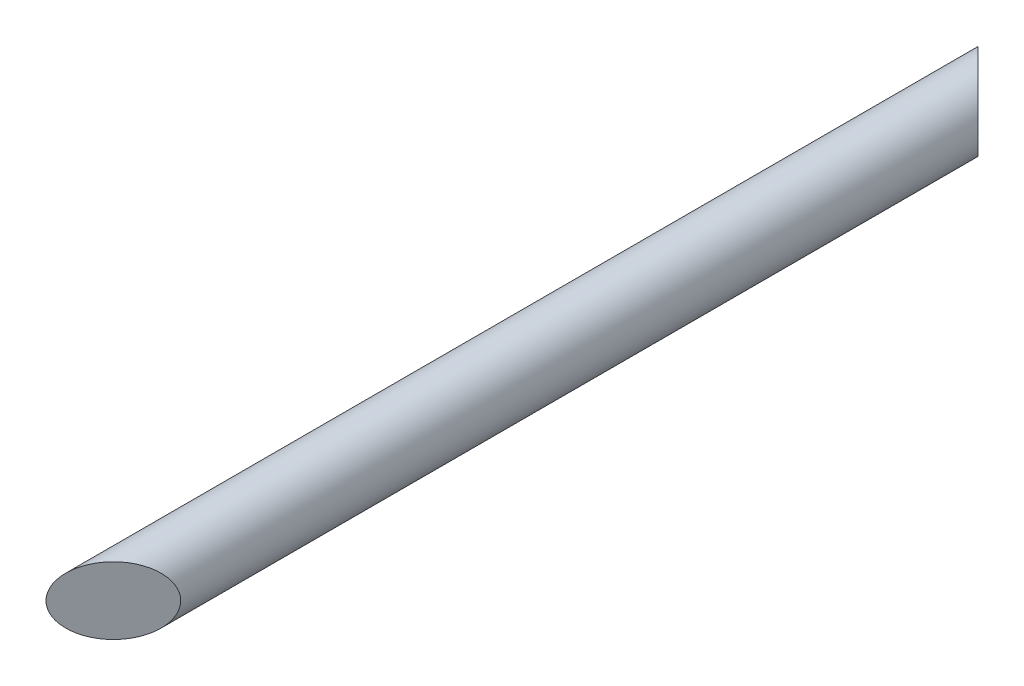
ISO-10303-21;
HEADER;
FILE_DESCRIPTION(('STEP AP214'),'2;1');
FILE_NAME('part.step','',(''),(''),'','','');
FILE_SCHEMA(('AUTOMOTIVE_DESIGN { 1 0 10303 214 1 1 1 1 }'));
ENDSEC;
DATA;
#1=APPLICATION_CONTEXT('core data for automotive mechanical design processes');
#2=APPLICATION_PROTOCOL_DEFINITION('international standard','automotive_design',2000,#1);
#3=PRODUCT_CONTEXT('',#1,'mechanical');
#4=PRODUCT('Part','Part','',(#3));
#5=PRODUCT_RELATED_PRODUCT_CATEGORY('part','',(#4));
#6=PRODUCT_DEFINITION_FORMATION('','',#4);
#7=PRODUCT_DEFINITION_CONTEXT('part definition',#1,'design');
#8=PRODUCT_DEFINITION('design','',#6,#7);
#9=PRODUCT_DEFINITION_SHAPE('','',#8);
#10=(LENGTH_UNIT() NAMED_UNIT(*) SI_UNIT(.MILLI.,.METRE.));
#11=(NAMED_UNIT(*) PLANE_ANGLE_UNIT() SI_UNIT($,.RADIAN.));
#12=(NAMED_UNIT(*) SI_UNIT($,.STERADIAN.) SOLID_ANGLE_UNIT());
#13=UNCERTAINTY_MEASURE_WITH_UNIT(LENGTH_MEASURE(1.E-05),#10,'distance_accuracy_value','');
#14=(GEOMETRIC_REPRESENTATION_CONTEXT(3) GLOBAL_UNCERTAINTY_ASSIGNED_CONTEXT((#13)) GLOBAL_UNIT_ASSIGNED_CONTEXT((#10,
#11,#12)) REPRESENTATION_CONTEXT('',''));
#15=CARTESIAN_POINT('',(0.,0.,0.));
#16=DIRECTION('',(0.,0.,1.));
#17=DIRECTION('',(1.,0.,0.));
#18=AXIS2_PLACEMENT_3D('',#15,#16,#17);
#19=CARTESIAN_POINT('',(0.,0.,830.));
#20=DIRECTION('',(0.,0.,-1.));
#21=DIRECTION('',(-1.,0.,0.));
#22=AXIS2_PLACEMENT_3D('',#19,#20,#21);
#23=CYLINDRICAL_SURFACE('',#22,30.);
#24=CARTESIAN_POINT('',(0.,0.,800.));
#25=DIRECTION('',(-0.707106781186547,0.,-0.707106781186548));
#26=DIRECTION('',(0.707106781186548,0.,-0.707106781186547));
#27=AXIS2_PLACEMENT_3D('',#24,#25,#26);
#28=ELLIPSE('',#27,42.4264068711928,30.);
#29=CARTESIAN_POINT('',(30.,0.,770.));
#30=VERTEX_POINT('',#29);
#31=EDGE_CURVE('E10',#30,#30,#28,.T.);
#32=ORIENTED_EDGE('',*,*,#31,.T.);
#33=EDGE_LOOP('',(#32));
#34=FACE_BOUND('',#33,.T.);
#35=CARTESIAN_POINT('',(0.,0.,30.0000000000004));
#36=DIRECTION('',(-0.707106781186548,0.,0.707106781186548));
#37=DIRECTION('',(-0.707106781186547,0.,-0.707106781186548));
#38=AXIS2_PLACEMENT_3D('',#35,#36,#37);
#39=ELLIPSE('',#38,42.4264068711928,30.);
#40=CARTESIAN_POINT('',(-30.,0.,3.64291929955129E-13));
#41=VERTEX_POINT('',#40);
#42=EDGE_CURVE('E49',#41,#41,#39,.T.);
#43=ORIENTED_EDGE('',*,*,#42,.T.);
#44=EDGE_LOOP('',(#43));
#45=FACE_BOUND('',#44,.T.);
#46=ADVANCED_FACE('F43',(#34,#45),#23,.T.);
#47=CARTESIAN_POINT('',(-30.,-30.,4.44089209850063E-13));
#48=DIRECTION('',(-0.707106781186548,0.,0.707106781186548));
#49=DIRECTION('',(0.707106781186547,0.,0.707106781186548));
#50=AXIS2_PLACEMENT_3D('',#47,#48,#49);
#51=PLANE('',#50);
#52=ORIENTED_EDGE('',*,*,#42,.F.);
#53=EDGE_LOOP('',(#52));
#54=FACE_BOUND('',#53,.T.);
#55=ADVANCED_FACE('F59',(#54),#51,.F.);
#56=CARTESIAN_POINT('',(30.,-30.,770.));
#57=DIRECTION('',(-0.707106781186547,0.,-0.707106781186548));
#58=DIRECTION('',(-0.707106781186548,0.,0.707106781186547));
#59=AXIS2_PLACEMENT_3D('',#56,#57,#58);
#60=PLANE('',#59);
#61=ORIENTED_EDGE('',*,*,#31,.F.);
#62=EDGE_LOOP('',(#61));
#63=FACE_BOUND('',#62,.T.);
#64=ADVANCED_FACE('F58',(#63),#60,.F.);
#65=CLOSED_SHELL('',(#46,#55,#64));
#66=MANIFOLD_SOLID_BREP('B2',#65);
#67=ADVANCED_BREP_SHAPE_REPRESENTATION('',(#18,#66),#14);
#68=SHAPE_DEFINITION_REPRESENTATION(#9,#67);
ENDSEC;
END-ISO-10303-21;
